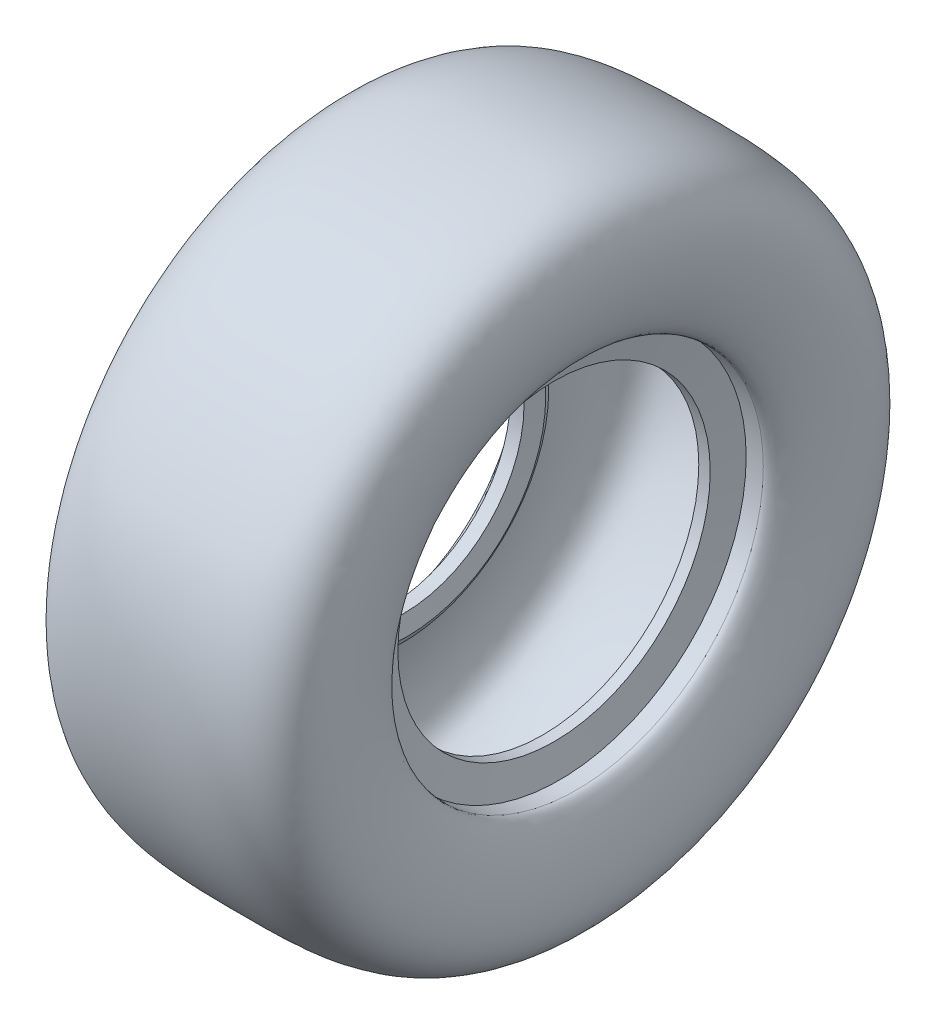
ISO-10303-21;
HEADER;
FILE_DESCRIPTION(('STEP AP214'),'2;1');
FILE_NAME('part.step','',(''),(''),'','','');
FILE_SCHEMA(('AUTOMOTIVE_DESIGN { 1 0 10303 214 1 1 1 1 }'));
ENDSEC;
DATA;
#1=APPLICATION_CONTEXT('core data for automotive mechanical design processes');
#2=APPLICATION_PROTOCOL_DEFINITION('international standard','automotive_design',2000,#1);
#3=PRODUCT_CONTEXT('',#1,'mechanical');
#4=PRODUCT('Part','Part','',(#3));
#5=PRODUCT_RELATED_PRODUCT_CATEGORY('part','',(#4));
#6=PRODUCT_DEFINITION_FORMATION('','',#4);
#7=PRODUCT_DEFINITION_CONTEXT('part definition',#1,'design');
#8=PRODUCT_DEFINITION('design','',#6,#7);
#9=PRODUCT_DEFINITION_SHAPE('','',#8);
#10=(LENGTH_UNIT() NAMED_UNIT(*) SI_UNIT(.MILLI.,.METRE.));
#11=(NAMED_UNIT(*) PLANE_ANGLE_UNIT() SI_UNIT($,.RADIAN.));
#12=(NAMED_UNIT(*) SI_UNIT($,.STERADIAN.) SOLID_ANGLE_UNIT());
#13=UNCERTAINTY_MEASURE_WITH_UNIT(LENGTH_MEASURE(1.E-05),#10,'distance_accuracy_value','');
#14=(GEOMETRIC_REPRESENTATION_CONTEXT(3) GLOBAL_UNCERTAINTY_ASSIGNED_CONTEXT((#13)) GLOBAL_UNIT_ASSIGNED_CONTEXT((#10,
#11,#12)) REPRESENTATION_CONTEXT('',''));
#15=CARTESIAN_POINT('',(0.,0.,0.));
#16=DIRECTION('',(0.,0.,1.));
#17=DIRECTION('',(1.,0.,0.));
#18=AXIS2_PLACEMENT_3D('',#15,#16,#17);
#19=CARTESIAN_POINT('',(3.47266272488094,0.,0.));
#20=DIRECTION('',(-1.,0.,0.));
#21=DIRECTION('',(0.,0.,1.));
#22=AXIS2_PLACEMENT_3D('',#19,#20,#21);
#23=CONICAL_SURFACE('',#22,17.2497028424639,0.404120577249094);
#24=CARTESIAN_POINT('',(0.594925280990503,0.,0.));
#25=DIRECTION('',(-1.,0.,0.));
#26=DIRECTION('',(0.,0.,1.));
#27=AXIS2_PLACEMENT_3D('',#24,#25,#26);
#28=CIRCLE('',#27,18.4803927868311);
#29=CARTESIAN_POINT('',(0.594925280990503,0.,18.4803927868311));
#30=VERTEX_POINT('',#29);
#31=EDGE_CURVE('E10',#30,#30,#28,.T.);
#32=ORIENTED_EDGE('',*,*,#31,.F.);
#33=EDGE_LOOP('',(#32));
#34=FACE_BOUND('',#33,.T.);
#35=CARTESIAN_POINT('',(3.47266272488094,0.,0.));
#36=DIRECTION('',(-1.,0.,0.));
#37=DIRECTION('',(0.,0.,1.));
#38=AXIS2_PLACEMENT_3D('',#35,#36,#37);
#39=CIRCLE('',#38,17.2497028424639);
#40=CARTESIAN_POINT('',(3.47266272488094,0.,17.2497028424639));
#41=VERTEX_POINT('',#40);
#42=EDGE_CURVE('E77',#41,#41,#39,.T.);
#43=ORIENTED_EDGE('',*,*,#42,.T.);
#44=EDGE_LOOP('',(#43));
#45=FACE_BOUND('',#44,.T.);
#46=ADVANCED_FACE('F31',(#34,#45),#23,.T.);
#47=CARTESIAN_POINT('',(0.594925280990491,18.4803927868311,0.));
#48=CARTESIAN_POINT('',(0.569372414542747,18.5081393680591,0.));
#49=CARTESIAN_POINT('',(0.525924239900733,18.5581848339355,0.));
#50=CARTESIAN_POINT('',(0.397789803641084,18.7197551683618,0.));
#51=CARTESIAN_POINT('',(0.20974377840643,18.9880501712404,0.));
#52=CARTESIAN_POINT('',(-0.0508523057953109,19.4100666384776,0.));
#53=CARTESIAN_POINT('',(-0.425084340900271,20.0840697441278,0.));
#54=CARTESIAN_POINT('',(-0.92303713033543,21.1101980177015,0.));
#55=CARTESIAN_POINT('',(-1.51660991726433,22.5639882404766,0.));
#56=CARTESIAN_POINT('',(-2.06345695898781,24.1779072461253,0.));
#57=CARTESIAN_POINT('',(-2.67668909722757,26.461967083874,0.));
#58=CARTESIAN_POINT('',(-3.13114524078678,29.4130902317947,0.));
#59=CARTESIAN_POINT('',(-2.90103725802214,32.5972257606739,0.));
#60=CARTESIAN_POINT('',(-1.98627137097752,34.5018215049126,0.));
#61=CARTESIAN_POINT('',(-0.815019700796387,35.5539158900898,0.));
#62=CARTESIAN_POINT('',(0.896449389503229,36.3885152191131,0.));
#63=CARTESIAN_POINT('',(4.17109004104652,36.9928783683698,0.));
#64=CARTESIAN_POINT('',(8.25481268728258,37.0872177282114,0.));
#65=CARTESIAN_POINT('',(11.7033864270957,37.062973692024,0.));
#66=CARTESIAN_POINT('',(15.1448426824585,37.0523134228786,0.));
#67=CARTESIAN_POINT('',(19.1330908105304,36.9300623418286,0.));
#68=CARTESIAN_POINT('',(22.2430027655649,36.2366041693048,0.));
#69=CARTESIAN_POINT('',(23.9001679162623,35.2636784086857,0.));
#70=CARTESIAN_POINT('',(24.7640377243279,34.3287891412374,0.));
#71=CARTESIAN_POINT('',(25.3525611301634,33.0512886276891,0.));
#72=CARTESIAN_POINT('',(25.6033579101598,31.0992616310925,0.));
#73=CARTESIAN_POINT('',(25.4706804883609,28.7019552678981,0.));
#74=CARTESIAN_POINT('',(25.1062391025157,26.7098719335728,0.));
#75=CARTESIAN_POINT('',(24.7182864232961,25.2972064642427,0.));
#76=CARTESIAN_POINT('',(24.3959823073389,24.3772942437871,0.));
#77=CARTESIAN_POINT('',(24.126684853968,23.7803682980975,0.));
#78=CARTESIAN_POINT('',(23.9235543703579,23.4257016547187,0.));
#79=CARTESIAN_POINT('',(23.8552897921762,23.3247909705258,0.));
#80=CARTESIAN_POINT('',(23.8123289766661,23.268126497952,0.));
#81=B_SPLINE_CURVE_WITH_KNOTS('',3,(#47,#48,#49,#50,#51,#52,#53,#54,#55,#56,#57,#58,#59,#60,#61,
#62,#63,#64,#65,#66,#67,#68,#69,#70,#71,#72,#73,#74,#75,#76,#77,#78,#79,#80),.UNSPECIFIED.,.F.,
.F.,(4,1,1,1,1,1,1,1,1,1,1,1,1,1,1,1,1,1,1,1,1,1,1,1,1,1,1,1,1,1,1,4),(0.0352319070333481,
0.0425536464305465,0.049875385827745,0.0645188646221418,0.0791623434165387,0.0938058222109355,
0.123092779799729,0.152379737388523,0.181666694977317,0.21095365256611,0.269527567743698,
0.328101482921285,0.386675398098873,0.415962355687666,0.44524931327646,0.503823228454047,
0.562397143631635,0.591684101220429,0.620971058809222,0.67954497398681,0.738118889164397,
0.767405846753191,0.796692804341985,0.825979761930778,0.855266719519572,0.884553677108366,
0.913840634697159,0.928484113491556,0.943127592285953,0.95777107108035,0.965092810477548,
0.972414549874747),.UNSPECIFIED.);
#82=CARTESIAN_POINT('',(-9.70191368152623,0.,0.));
#83=DIRECTION('',(-1.,0.,0.));
#84=AXIS1_PLACEMENT('',#82,#83);
#85=SURFACE_OF_REVOLUTION('',#81,#84);
#86=CARTESIAN_POINT('',(23.9646770950238,0.,0.));
#87=DIRECTION('',(-1.,0.,0.));
#88=DIRECTION('',(0.,0.,1.));
#89=AXIS2_PLACEMENT_3D('',#86,#87,#88);
#90=CIRCLE('',#89,23.499584039787);
#91=CARTESIAN_POINT('',(23.9646770950238,0.,23.499584039787));
#92=VERTEX_POINT('',#91);
#93=EDGE_CURVE('E37',#92,#92,#90,.T.);
#94=ORIENTED_EDGE('',*,*,#93,.F.);
#95=EDGE_LOOP('',(#94));
#96=FACE_BOUND('',#95,.T.);
#97=ORIENTED_EDGE('',*,*,#31,.T.);
#98=EDGE_LOOP('',(#97));
#99=FACE_BOUND('',#98,.T.);
#100=ADVANCED_FACE('F120',(#96,#99),#85,.T.);
#101=CARTESIAN_POINT('',(21.3475901713786,0.,0.));
#102=DIRECTION('',(-1.,0.,0.));
#103=DIRECTION('',(0.,0.,1.));
#104=AXIS2_PLACEMENT_3D('',#101,#102,#103);
#105=CONICAL_SURFACE('',#104,24.4010866834856,0.331738040239119);
#106=ORIENTED_EDGE('',*,*,#93,.T.);
#107=EDGE_LOOP('',(#106));
#108=FACE_BOUND('',#107,.T.);
#109=CARTESIAN_POINT('',(21.3475901713786,0.,0.));
#110=DIRECTION('',(-1.,0.,0.));
#111=DIRECTION('',(0.,0.,1.));
#112=AXIS2_PLACEMENT_3D('',#109,#110,#111);
#113=CIRCLE('',#112,24.4010866834856);
#114=CARTESIAN_POINT('',(21.3475901713786,0.,24.4010866834856));
#115=VERTEX_POINT('',#114);
#116=EDGE_CURVE('E41',#115,#115,#113,.T.);
#117=ORIENTED_EDGE('',*,*,#116,.F.);
#118=EDGE_LOOP('',(#117));
#119=FACE_BOUND('',#118,.T.);
#120=ADVANCED_FACE('F117',(#108,#119),#105,.T.);
#121=CARTESIAN_POINT('',(20.,0.,0.));
#122=DIRECTION('',(1.,0.,0.));
#123=DIRECTION('',(0.,0.,-1.));
#124=AXIS2_PLACEMENT_3D('',#121,#122,#123);
#125=CONICAL_SURFACE('',#124,21.25,1.16667574954581);
#126=ORIENTED_EDGE('',*,*,#116,.T.);
#127=EDGE_LOOP('',(#126));
#128=FACE_BOUND('',#127,.T.);
#129=CARTESIAN_POINT('',(20.,0.,0.));
#130=DIRECTION('',(-1.,0.,0.));
#131=DIRECTION('',(0.,0.,1.));
#132=AXIS2_PLACEMENT_3D('',#129,#130,#131);
#133=CIRCLE('',#132,21.25);
#134=CARTESIAN_POINT('',(20.,0.,21.25));
#135=VERTEX_POINT('',#134);
#136=EDGE_CURVE('E45',#135,#135,#133,.T.);
#137=ORIENTED_EDGE('',*,*,#136,.F.);
#138=EDGE_LOOP('',(#137));
#139=FACE_BOUND('',#138,.T.);
#140=ADVANCED_FACE('F113',(#128,#139),#125,.T.);
#141=CARTESIAN_POINT('',(20.,0.,0.));
#142=DIRECTION('',(1.,0.,0.));
#143=DIRECTION('',(0.,0.,-1.));
#144=AXIS2_PLACEMENT_3D('',#141,#142,#143);
#145=PLANE('',#144);
#146=CARTESIAN_POINT('',(20.,0.,0.));
#147=DIRECTION('',(-1.,0.,0.));
#148=DIRECTION('',(0.,0.,1.));
#149=AXIS2_PLACEMENT_3D('',#146,#147,#148);
#150=CIRCLE('',#149,18.4);
#151=CARTESIAN_POINT('',(20.,0.,18.4));
#152=VERTEX_POINT('',#151);
#153=EDGE_CURVE('E50',#152,#152,#150,.T.);
#154=ORIENTED_EDGE('',*,*,#153,.F.);
#155=EDGE_LOOP('',(#154));
#156=FACE_BOUND('',#155,.T.);
#157=ORIENTED_EDGE('',*,*,#136,.T.);
#158=EDGE_LOOP('',(#157));
#159=FACE_BOUND('',#158,.T.);
#160=ADVANCED_FACE('F109',(#156,#159),#145,.F.);
#161=CARTESIAN_POINT('',(-9.70191368152623,0.,0.));
#162=DIRECTION('',(-1.,0.,0.));
#163=DIRECTION('',(0.,0.,1.));
#164=AXIS2_PLACEMENT_3D('',#161,#162,#163);
#165=CYLINDRICAL_SURFACE('',#164,18.4);
#166=ORIENTED_EDGE('',*,*,#153,.T.);
#167=EDGE_LOOP('',(#166));
#168=FACE_BOUND('',#167,.T.);
#169=CARTESIAN_POINT('',(21.3475901713787,0.,0.));
#170=DIRECTION('',(-1.,0.,0.));
#171=DIRECTION('',(0.,0.,1.));
#172=AXIS2_PLACEMENT_3D('',#169,#170,#171);
#173=CIRCLE('',#172,18.4);
#174=CARTESIAN_POINT('',(21.3475901713787,0.,18.4));
#175=VERTEX_POINT('',#174);
#176=EDGE_CURVE('E53',#175,#175,#173,.T.);
#177=ORIENTED_EDGE('',*,*,#176,.F.);
#178=EDGE_LOOP('',(#177));
#179=FACE_BOUND('',#178,.T.);
#180=ADVANCED_FACE('F105',(#168,#179),#165,.F.);
#181=CARTESIAN_POINT('',(21.9823673019292,0.,0.));
#182=DIRECTION('',(1.,0.,0.));
#183=DIRECTION('',(0.,0.,-1.));
#184=AXIS2_PLACEMENT_3D('',#181,#182,#183);
#185=CONICAL_SURFACE('',#184,22.,1.39626340159546);
#186=ORIENTED_EDGE('',*,*,#176,.T.);
#187=EDGE_LOOP('',(#186));
#188=FACE_BOUND('',#187,.T.);
#189=CARTESIAN_POINT('',(21.9823673019292,0.,0.));
#190=DIRECTION('',(-1.,0.,0.));
#191=DIRECTION('',(0.,0.,1.));
#192=AXIS2_PLACEMENT_3D('',#189,#190,#191);
#193=CIRCLE('',#192,22.);
#194=CARTESIAN_POINT('',(21.9823673019292,0.,22.));
#195=VERTEX_POINT('',#194);
#196=EDGE_CURVE('E56',#195,#195,#193,.T.);
#197=ORIENTED_EDGE('',*,*,#196,.F.);
#198=EDGE_LOOP('',(#197));
#199=FACE_BOUND('',#198,.T.);
#200=ADVANCED_FACE('F101',(#188,#199),#185,.F.);
#201=CARTESIAN_POINT('',(-9.70191368152623,0.,0.));
#202=DIRECTION('',(-1.,0.,0.));
#203=DIRECTION('',(0.,0.,1.));
#204=AXIS2_PLACEMENT_3D('',#201,#202,#203);
#205=CYLINDRICAL_SURFACE('',#204,22.);
#206=ORIENTED_EDGE('',*,*,#196,.T.);
#207=EDGE_LOOP('',(#206));
#208=FACE_BOUND('',#207,.T.);
#209=CARTESIAN_POINT('',(24.,0.,0.));
#210=DIRECTION('',(-1.,0.,0.));
#211=DIRECTION('',(0.,0.,1.));
#212=AXIS2_PLACEMENT_3D('',#209,#210,#211);
#213=CIRCLE('',#212,22.);
#214=CARTESIAN_POINT('',(24.,0.,22.));
#215=VERTEX_POINT('',#214);
#216=EDGE_CURVE('E59',#215,#215,#213,.T.);
#217=ORIENTED_EDGE('',*,*,#216,.F.);
#218=EDGE_LOOP('',(#217));
#219=FACE_BOUND('',#218,.T.);
#220=ADVANCED_FACE('F96',(#208,#219),#205,.F.);
#221=CARTESIAN_POINT('',(0.,17.125,0.));
#222=CARTESIAN_POINT('',(-1.63878066882199,17.3562966084539,0.));
#223=CARTESIAN_POINT('',(-11.288304265849,38.6849759848854,0.));
#224=CARTESIAN_POINT('',(13.6797692681942,38.4103130216317,0.));
#225=CARTESIAN_POINT('',(29.9662875421091,38.7543069486207,0.));
#226=CARTESIAN_POINT('',(25.4776633391417,22.0348065599062,0.));
#227=CARTESIAN_POINT('',(24.,22.,0.));
#228=B_SPLINE_CURVE_WITH_KNOTS('',3,(#221,#222,#223,#224,#225,#226,#227),.UNSPECIFIED.,.F.,.F.,
(4,1,1,1,4),(0.,0.417457681233407,0.595980708620633,0.83131266485226,1.),.UNSPECIFIED.);
#229=CARTESIAN_POINT('',(-9.70191368152623,0.,0.));
#230=DIRECTION('',(-1.,0.,0.));
#231=AXIS1_PLACEMENT('',#229,#230);
#232=SURFACE_OF_REVOLUTION('',#228,#231);
#233=ORIENTED_EDGE('',*,*,#216,.T.);
#234=EDGE_LOOP('',(#233));
#235=FACE_BOUND('',#234,.T.);
#236=CARTESIAN_POINT('',(0.,0.,0.));
#237=DIRECTION('',(-1.,0.,0.));
#238=DIRECTION('',(0.,0.,1.));
#239=AXIS2_PLACEMENT_3D('',#236,#237,#238);
#240=CIRCLE('',#239,17.125);
#241=CARTESIAN_POINT('',(0.,0.,17.125));
#242=VERTEX_POINT('',#241);
#243=EDGE_CURVE('E62',#242,#242,#240,.T.);
#244=ORIENTED_EDGE('',*,*,#243,.F.);
#245=EDGE_LOOP('',(#244));
#246=FACE_BOUND('',#245,.T.);
#247=ADVANCED_FACE('F91',(#235,#246),#232,.F.);
#248=CARTESIAN_POINT('',(-9.70191368152623,0.,0.));
#249=DIRECTION('',(-1.,0.,0.));
#250=DIRECTION('',(0.,0.,1.));
#251=AXIS2_PLACEMENT_3D('',#248,#249,#250);
#252=CYLINDRICAL_SURFACE('',#251,17.125);
#253=ORIENTED_EDGE('',*,*,#243,.T.);
#254=EDGE_LOOP('',(#253));
#255=FACE_BOUND('',#254,.T.);
#256=CARTESIAN_POINT('',(1.99999999999999,0.,0.));
#257=DIRECTION('',(-1.,0.,0.));
#258=DIRECTION('',(0.,0.,1.));
#259=AXIS2_PLACEMENT_3D('',#256,#257,#258);
#260=CIRCLE('',#259,17.125);
#261=CARTESIAN_POINT('',(1.99999999999999,0.,17.125));
#262=VERTEX_POINT('',#261);
#263=EDGE_CURVE('E65',#262,#262,#260,.T.);
#264=ORIENTED_EDGE('',*,*,#263,.F.);
#265=EDGE_LOOP('',(#264));
#266=FACE_BOUND('',#265,.T.);
#267=ADVANCED_FACE('F95',(#255,#266),#252,.F.);
#268=CARTESIAN_POINT('',(1.99999999999999,0.,0.));
#269=DIRECTION('',(1.,0.,0.));
#270=DIRECTION('',(0.,0.,-1.));
#271=AXIS2_PLACEMENT_3D('',#268,#269,#270);
#272=PLANE('',#271);
#273=CARTESIAN_POINT('',(1.99999999999999,0.,0.));
#274=DIRECTION('',(-1.,0.,0.));
#275=DIRECTION('',(0.,0.,1.));
#276=AXIS2_PLACEMENT_3D('',#273,#274,#275);
#277=CIRCLE('',#276,14.2);
#278=CARTESIAN_POINT('',(1.99999999999999,0.,14.2));
#279=VERTEX_POINT('',#278);
#280=EDGE_CURVE('E68',#279,#279,#277,.T.);
#281=ORIENTED_EDGE('',*,*,#280,.F.);
#282=EDGE_LOOP('',(#281));
#283=FACE_BOUND('',#282,.T.);
#284=ORIENTED_EDGE('',*,*,#263,.T.);
#285=EDGE_LOOP('',(#284));
#286=FACE_BOUND('',#285,.T.);
#287=ADVANCED_FACE('F146',(#283,#286),#272,.F.);
#288=CARTESIAN_POINT('',(-9.70191368152623,0.,0.));
#289=DIRECTION('',(-1.,0.,0.));
#290=DIRECTION('',(0.,0.,1.));
#291=AXIS2_PLACEMENT_3D('',#288,#289,#290);
#292=CYLINDRICAL_SURFACE('',#291,14.2);
#293=ORIENTED_EDGE('',*,*,#280,.T.);
#294=EDGE_LOOP('',(#293));
#295=FACE_BOUND('',#294,.T.);
#296=CARTESIAN_POINT('',(3.61208064244136,0.,0.));
#297=DIRECTION('',(-1.,0.,0.));
#298=DIRECTION('',(0.,0.,1.));
#299=AXIS2_PLACEMENT_3D('',#296,#297,#298);
#300=CIRCLE('',#299,14.2);
#301=CARTESIAN_POINT('',(3.61208064244136,0.,14.2));
#302=VERTEX_POINT('',#301);
#303=EDGE_CURVE('E71',#302,#302,#300,.T.);
#304=ORIENTED_EDGE('',*,*,#303,.F.);
#305=EDGE_LOOP('',(#304));
#306=FACE_BOUND('',#305,.T.);
#307=ADVANCED_FACE('F140',(#295,#306),#292,.F.);
#308=CARTESIAN_POINT('',(3.99559182548228,0.,0.));
#309=DIRECTION('',(1.,0.,0.));
#310=DIRECTION('',(0.,0.,-1.));
#311=AXIS2_PLACEMENT_3D('',#308,#309,#310);
#312=CONICAL_SURFACE('',#311,16.375,1.39626340159546);
#313=ORIENTED_EDGE('',*,*,#303,.T.);
#314=EDGE_LOOP('',(#313));
#315=FACE_BOUND('',#314,.T.);
#316=CARTESIAN_POINT('',(3.99559182548228,0.,0.));
#317=DIRECTION('',(-1.,0.,0.));
#318=DIRECTION('',(0.,0.,1.));
#319=AXIS2_PLACEMENT_3D('',#316,#317,#318);
#320=CIRCLE('',#319,16.375);
#321=CARTESIAN_POINT('',(3.99559182548228,0.,16.375));
#322=VERTEX_POINT('',#321);
#323=EDGE_CURVE('E74',#322,#322,#320,.T.);
#324=ORIENTED_EDGE('',*,*,#323,.F.);
#325=EDGE_LOOP('',(#324));
#326=FACE_BOUND('',#325,.T.);
#327=ADVANCED_FACE('F135',(#315,#326),#312,.F.);
#328=CARTESIAN_POINT('',(3.99559182548228,0.,0.));
#329=DIRECTION('',(-1.,0.,0.));
#330=DIRECTION('',(0.,0.,1.));
#331=AXIS2_PLACEMENT_3D('',#328,#329,#330);
#332=CONICAL_SURFACE('',#331,16.375,1.03196930990185);
#333=ORIENTED_EDGE('',*,*,#42,.F.);
#334=EDGE_LOOP('',(#333));
#335=FACE_BOUND('',#334,.T.);
#336=ORIENTED_EDGE('',*,*,#323,.T.);
#337=EDGE_LOOP('',(#336));
#338=FACE_BOUND('',#337,.T.);
#339=ADVANCED_FACE('F132',(#335,#338),#332,.T.);
#340=CLOSED_SHELL('',(#46,#100,#120,#140,#160,#180,#200,#220,#247,#267,#287,#307,#327,#339));
#341=MANIFOLD_SOLID_BREP('B2',#340);
#342=ADVANCED_BREP_SHAPE_REPRESENTATION('',(#18,#341),#14);
#343=SHAPE_DEFINITION_REPRESENTATION(#9,#342);
ENDSEC;
END-ISO-10303-21;
